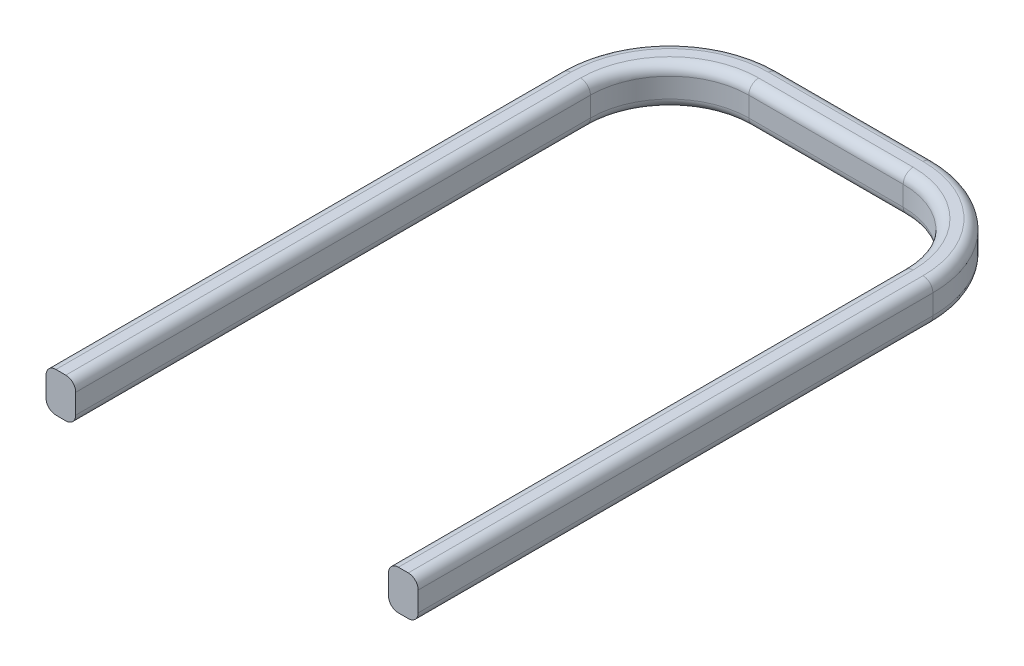
ISO-10303-21;
HEADER;
FILE_DESCRIPTION(('STEP AP214'),'2;1');
FILE_NAME('part.step','',(''),(''),'','','');
FILE_SCHEMA(('AUTOMOTIVE_DESIGN { 1 0 10303 214 1 1 1 1 }'));
ENDSEC;
DATA;
#1=APPLICATION_CONTEXT('core data for automotive mechanical design processes');
#2=APPLICATION_PROTOCOL_DEFINITION('international standard','automotive_design',2000,#1);
#3=PRODUCT_CONTEXT('',#1,'mechanical');
#4=PRODUCT('Part','Part','',(#3));
#5=PRODUCT_RELATED_PRODUCT_CATEGORY('part','',(#4));
#6=PRODUCT_DEFINITION_FORMATION('','',#4);
#7=PRODUCT_DEFINITION_CONTEXT('part definition',#1,'design');
#8=PRODUCT_DEFINITION('design','',#6,#7);
#9=PRODUCT_DEFINITION_SHAPE('','',#8);
#10=(LENGTH_UNIT() NAMED_UNIT(*) SI_UNIT(.MILLI.,.METRE.));
#11=(NAMED_UNIT(*) PLANE_ANGLE_UNIT() SI_UNIT($,.RADIAN.));
#12=(NAMED_UNIT(*) SI_UNIT($,.STERADIAN.) SOLID_ANGLE_UNIT());
#13=UNCERTAINTY_MEASURE_WITH_UNIT(LENGTH_MEASURE(1.E-05),#10,'distance_accuracy_value','');
#14=(GEOMETRIC_REPRESENTATION_CONTEXT(3) GLOBAL_UNCERTAINTY_ASSIGNED_CONTEXT((#13)) GLOBAL_UNIT_ASSIGNED_CONTEXT((#10,
#11,#12)) REPRESENTATION_CONTEXT('',''));
#15=CARTESIAN_POINT('',(0.,0.,0.));
#16=DIRECTION('',(0.,0.,1.));
#17=DIRECTION('',(1.,0.,0.));
#18=AXIS2_PLACEMENT_3D('',#15,#16,#17);
#19=CARTESIAN_POINT('',(3.95,1.,7.5));
#20=DIRECTION('',(0.,0.,-1.));
#21=DIRECTION('',(-1.,0.,0.));
#22=AXIS2_PLACEMENT_3D('',#19,#20,#21);
#23=PLANE('',#22);
#24=DIRECTION('',(0.,-1.,0.));
#25=VECTOR('',#24,1.);
#26=CARTESIAN_POINT('',(4.7,1.,7.5));
#27=LINE('',#26,#25);
#28=CARTESIAN_POINT('',(4.7,0.75,7.5));
#29=VERTEX_POINT('',#28);
#30=CARTESIAN_POINT('',(4.7,0.25,7.5));
#31=VERTEX_POINT('',#30);
#32=EDGE_CURVE('E232',#29,#31,#27,.T.);
#33=ORIENTED_EDGE('',*,*,#32,.F.);
#34=CARTESIAN_POINT('',(4.45,0.75,7.5));
#35=DIRECTION('',(0.,0.,-1.));
#36=DIRECTION('',(-1.,0.,0.));
#37=AXIS2_PLACEMENT_3D('',#34,#35,#36);
#38=CIRCLE('',#37,0.25);
#39=CARTESIAN_POINT('',(4.45,1.,7.5));
#40=VERTEX_POINT('',#39);
#41=EDGE_CURVE('E324',#29,#40,#38,.F.);
#42=ORIENTED_EDGE('',*,*,#41,.T.);
#43=DIRECTION('',(1.,0.,0.));
#44=VECTOR('',#43,1.);
#45=CARTESIAN_POINT('',(3.95,1.,7.5));
#46=LINE('',#45,#44);
#47=CARTESIAN_POINT('',(4.2,1.,7.5));
#48=VERTEX_POINT('',#47);
#49=EDGE_CURVE('E459',#48,#40,#46,.T.);
#50=ORIENTED_EDGE('',*,*,#49,.F.);
#51=CARTESIAN_POINT('',(4.2,0.75,7.5));
#52=DIRECTION('',(0.,0.,-1.));
#53=DIRECTION('',(-1.,0.,0.));
#54=AXIS2_PLACEMENT_3D('',#51,#52,#53);
#55=CIRCLE('',#54,0.25);
#56=CARTESIAN_POINT('',(3.95,0.75,7.5));
#57=VERTEX_POINT('',#56);
#58=EDGE_CURVE('E64',#48,#57,#55,.F.);
#59=ORIENTED_EDGE('',*,*,#58,.T.);
#60=DIRECTION('',(0.,-1.,0.));
#61=VECTOR('',#60,1.);
#62=CARTESIAN_POINT('',(3.95,1.,7.5));
#63=LINE('',#62,#61);
#64=CARTESIAN_POINT('',(3.95,0.25,7.5));
#65=VERTEX_POINT('',#64);
#66=EDGE_CURVE('E464',#57,#65,#63,.T.);
#67=ORIENTED_EDGE('',*,*,#66,.T.);
#68=CARTESIAN_POINT('',(4.2,0.25,7.5));
#69=DIRECTION('',(0.,0.,-1.));
#70=DIRECTION('',(-1.,0.,0.));
#71=AXIS2_PLACEMENT_3D('',#68,#69,#70);
#72=CIRCLE('',#71,0.25);
#73=CARTESIAN_POINT('',(4.2,0.,7.5));
#74=VERTEX_POINT('',#73);
#75=EDGE_CURVE('E319',#65,#74,#72,.F.);
#76=ORIENTED_EDGE('',*,*,#75,.T.);
#77=DIRECTION('',(1.,0.,0.));
#78=VECTOR('',#77,1.);
#79=CARTESIAN_POINT('',(3.95,0.,7.5));
#80=LINE('',#79,#78);
#81=CARTESIAN_POINT('',(4.45,0.,7.5));
#82=VERTEX_POINT('',#81);
#83=EDGE_CURVE('E340',#74,#82,#80,.T.);
#84=ORIENTED_EDGE('',*,*,#83,.T.);
#85=CARTESIAN_POINT('',(4.45,0.25,7.5));
#86=DIRECTION('',(0.,0.,-1.));
#87=DIRECTION('',(-1.,0.,0.));
#88=AXIS2_PLACEMENT_3D('',#85,#86,#87);
#89=CIRCLE('',#88,0.25);
#90=EDGE_CURVE('E321',#82,#31,#89,.F.);
#91=ORIENTED_EDGE('',*,*,#90,.T.);
#92=EDGE_LOOP('',(#33,#42,#50,#59,#67,#76,#84,#91));
#93=FACE_BOUND('',#92,.T.);
#94=ADVANCED_FACE('F41',(#93),#23,.F.);
#95=CARTESIAN_POINT('',(4.7,1.,-5.49999999999998));
#96=DIRECTION('',(-1.,0.,0.));
#97=DIRECTION('',(0.,0.,1.));
#98=AXIS2_PLACEMENT_3D('',#95,#96,#97);
#99=PLANE('',#98);
#100=DIRECTION('',(0.,-1.,0.));
#101=VECTOR('',#100,1.);
#102=CARTESIAN_POINT('',(4.7,1.,-5.49999999999998));
#103=LINE('',#102,#101);
#104=CARTESIAN_POINT('',(4.7,0.75,-5.49999999999998));
#105=VERTEX_POINT('',#104);
#106=CARTESIAN_POINT('',(4.7,0.25,-5.49999999999998));
#107=VERTEX_POINT('',#106);
#108=EDGE_CURVE('E236',#105,#107,#103,.T.);
#109=ORIENTED_EDGE('',*,*,#108,.F.);
#110=DIRECTION('',(0.,0.,-1.));
#111=VECTOR('',#110,1.);
#112=CARTESIAN_POINT('',(4.7,0.75,-5.49999999999998));
#113=LINE('',#112,#111);
#114=EDGE_CURVE('E317',#105,#29,#113,.F.);
#115=ORIENTED_EDGE('',*,*,#114,.T.);
#116=ORIENTED_EDGE('',*,*,#32,.T.);
#117=DIRECTION('',(0.,0.,-1.));
#118=VECTOR('',#117,1.);
#119=CARTESIAN_POINT('',(4.7,0.25,-5.49999999999998));
#120=LINE('',#119,#118);
#121=EDGE_CURVE('E315',#31,#107,#120,.T.);
#122=ORIENTED_EDGE('',*,*,#121,.T.);
#123=EDGE_LOOP('',(#109,#115,#116,#122));
#124=FACE_BOUND('',#123,.T.);
#125=ADVANCED_FACE('F450',(#124),#99,.F.);
#126=CARTESIAN_POINT('',(1.95,1.,-5.5));
#127=DIRECTION('',(0.,-1.,0.));
#128=DIRECTION('',(0.,0.,-1.));
#129=AXIS2_PLACEMENT_3D('',#126,#127,#128);
#130=CYLINDRICAL_SURFACE('',#129,2.75);
#131=ORIENTED_EDGE('',*,*,#108,.T.);
#132=CARTESIAN_POINT('',(1.95,0.25,-5.5));
#133=DIRECTION('',(0.,-1.,0.));
#134=DIRECTION('',(0.,0.,-1.));
#135=AXIS2_PLACEMENT_3D('',#132,#133,#134);
#136=CIRCLE('',#135,2.75);
#137=CARTESIAN_POINT('',(1.94999999999999,0.25,-8.25));
#138=VERTEX_POINT('',#137);
#139=EDGE_CURVE('E274',#107,#138,#136,.F.);
#140=ORIENTED_EDGE('',*,*,#139,.T.);
#141=DIRECTION('',(0.,-1.,0.));
#142=VECTOR('',#141,1.);
#143=CARTESIAN_POINT('',(1.94999999999999,1.,-8.25));
#144=LINE('',#143,#142);
#145=CARTESIAN_POINT('',(1.94999999999999,0.75,-8.25));
#146=VERTEX_POINT('',#145);
#147=EDGE_CURVE('E400',#146,#138,#144,.T.);
#148=ORIENTED_EDGE('',*,*,#147,.F.);
#149=CARTESIAN_POINT('',(1.95,0.75,-5.5));
#150=DIRECTION('',(0.,-1.,0.));
#151=DIRECTION('',(0.,0.,-1.));
#152=AXIS2_PLACEMENT_3D('',#149,#150,#151);
#153=CIRCLE('',#152,2.75);
#154=EDGE_CURVE('E272',#146,#105,#153,.T.);
#155=ORIENTED_EDGE('',*,*,#154,.T.);
#156=EDGE_LOOP('',(#131,#140,#148,#155));
#157=FACE_BOUND('',#156,.T.);
#158=ADVANCED_FACE('F406',(#157),#130,.T.);
#159=CARTESIAN_POINT('',(-1.94999999999998,1.,-8.25));
#160=DIRECTION('',(0.,0.,1.));
#161=DIRECTION('',(1.,0.,0.));
#162=AXIS2_PLACEMENT_3D('',#159,#160,#161);
#163=PLANE('',#162);
#164=ORIENTED_EDGE('',*,*,#147,.T.);
#165=DIRECTION('',(-1.,0.,0.));
#166=VECTOR('',#165,1.);
#167=CARTESIAN_POINT('',(-1.95,0.25,-8.25));
#168=LINE('',#167,#166);
#169=CARTESIAN_POINT('',(-1.95,0.25,-8.25));
#170=VERTEX_POINT('',#169);
#171=EDGE_CURVE('E270',#138,#170,#168,.T.);
#172=ORIENTED_EDGE('',*,*,#171,.T.);
#173=DIRECTION('',(0.,-1.,0.));
#174=VECTOR('',#173,1.);
#175=CARTESIAN_POINT('',(-1.95,1.,-8.25));
#176=LINE('',#175,#174);
#177=CARTESIAN_POINT('',(-1.95,0.75,-8.25));
#178=VERTEX_POINT('',#177);
#179=EDGE_CURVE('E397',#178,#170,#176,.T.);
#180=ORIENTED_EDGE('',*,*,#179,.F.);
#181=DIRECTION('',(-1.,0.,0.));
#182=VECTOR('',#181,1.);
#183=CARTESIAN_POINT('',(-1.94999999999998,0.75,-8.25));
#184=LINE('',#183,#182);
#185=EDGE_CURVE('E268',#178,#146,#184,.F.);
#186=ORIENTED_EDGE('',*,*,#185,.T.);
#187=EDGE_LOOP('',(#164,#172,#180,#186));
#188=FACE_BOUND('',#187,.T.);
#189=ADVANCED_FACE('F429',(#188),#163,.F.);
#190=CARTESIAN_POINT('',(-1.95,1.,-5.5));
#191=DIRECTION('',(0.,-1.,0.));
#192=DIRECTION('',(0.,0.,-1.));
#193=AXIS2_PLACEMENT_3D('',#190,#191,#192);
#194=CYLINDRICAL_SURFACE('',#193,2.75);
#195=ORIENTED_EDGE('',*,*,#179,.T.);
#196=CARTESIAN_POINT('',(-1.95,0.25,-5.5));
#197=DIRECTION('',(0.,-1.,0.));
#198=DIRECTION('',(0.,0.,-1.));
#199=AXIS2_PLACEMENT_3D('',#196,#197,#198);
#200=CIRCLE('',#199,2.75);
#201=CARTESIAN_POINT('',(-4.7,0.25,-5.49999999999999));
#202=VERTEX_POINT('',#201);
#203=EDGE_CURVE('E266',#170,#202,#200,.F.);
#204=ORIENTED_EDGE('',*,*,#203,.T.);
#205=DIRECTION('',(0.,-1.,0.));
#206=VECTOR('',#205,1.);
#207=CARTESIAN_POINT('',(-4.7,1.,-5.49999999999999));
#208=LINE('',#207,#206);
#209=CARTESIAN_POINT('',(-4.7,0.75,-5.49999999999999));
#210=VERTEX_POINT('',#209);
#211=EDGE_CURVE('E224',#210,#202,#208,.T.);
#212=ORIENTED_EDGE('',*,*,#211,.F.);
#213=CARTESIAN_POINT('',(-1.95,0.75,-5.5));
#214=DIRECTION('',(0.,-1.,0.));
#215=DIRECTION('',(0.,0.,-1.));
#216=AXIS2_PLACEMENT_3D('',#213,#214,#215);
#217=CIRCLE('',#216,2.75);
#218=EDGE_CURVE('E264',#210,#178,#217,.T.);
#219=ORIENTED_EDGE('',*,*,#218,.T.);
#220=EDGE_LOOP('',(#195,#204,#212,#219));
#221=FACE_BOUND('',#220,.T.);
#222=ADVANCED_FACE('F432',(#221),#194,.T.);
#223=CARTESIAN_POINT('',(-4.7,1.,-5.49999999999999));
#224=DIRECTION('',(1.,0.,0.));
#225=DIRECTION('',(0.,0.,-1.));
#226=AXIS2_PLACEMENT_3D('',#223,#224,#225);
#227=PLANE('',#226);
#228=ORIENTED_EDGE('',*,*,#211,.T.);
#229=DIRECTION('',(0.,0.,1.));
#230=VECTOR('',#229,1.);
#231=CARTESIAN_POINT('',(-4.7,0.25,7.5));
#232=LINE('',#231,#230);
#233=CARTESIAN_POINT('',(-4.7,0.25,7.5));
#234=VERTEX_POINT('',#233);
#235=EDGE_CURVE('E223',#202,#234,#232,.T.);
#236=ORIENTED_EDGE('',*,*,#235,.T.);
#237=DIRECTION('',(0.,-1.,0.));
#238=VECTOR('',#237,1.);
#239=CARTESIAN_POINT('',(-4.7,1.,7.5));
#240=LINE('',#239,#238);
#241=CARTESIAN_POINT('',(-4.7,0.75,7.5));
#242=VERTEX_POINT('',#241);
#243=EDGE_CURVE('E207',#242,#234,#240,.T.);
#244=ORIENTED_EDGE('',*,*,#243,.F.);
#245=DIRECTION('',(0.,0.,1.));
#246=VECTOR('',#245,1.);
#247=CARTESIAN_POINT('',(-4.7,0.75,-5.49999999999999));
#248=LINE('',#247,#246);
#249=EDGE_CURVE('E220',#242,#210,#248,.F.);
#250=ORIENTED_EDGE('',*,*,#249,.T.);
#251=EDGE_LOOP('',(#228,#236,#244,#250));
#252=FACE_BOUND('',#251,.T.);
#253=ADVANCED_FACE('F219',(#252),#227,.F.);
#254=CARTESIAN_POINT('',(-4.7,1.,7.5));
#255=DIRECTION('',(0.,0.,-1.));
#256=DIRECTION('',(-1.,0.,0.));
#257=AXIS2_PLACEMENT_3D('',#254,#255,#256);
#258=PLANE('',#257);
#259=ORIENTED_EDGE('',*,*,#243,.T.);
#260=CARTESIAN_POINT('',(-4.45,0.25,7.5));
#261=DIRECTION('',(0.,0.,-1.));
#262=DIRECTION('',(-1.,0.,0.));
#263=AXIS2_PLACEMENT_3D('',#260,#261,#262);
#264=CIRCLE('',#263,0.25);
#265=CARTESIAN_POINT('',(-4.45,0.,7.5));
#266=VERTEX_POINT('',#265);
#267=EDGE_CURVE('E242',#234,#266,#264,.F.);
#268=ORIENTED_EDGE('',*,*,#267,.T.);
#269=DIRECTION('',(1.,0.,0.));
#270=VECTOR('',#269,1.);
#271=CARTESIAN_POINT('',(-4.7,0.,7.5));
#272=LINE('',#271,#270);
#273=CARTESIAN_POINT('',(-4.2,0.,7.5));
#274=VERTEX_POINT('',#273);
#275=EDGE_CURVE('E457',#266,#274,#272,.T.);
#276=ORIENTED_EDGE('',*,*,#275,.T.);
#277=CARTESIAN_POINT('',(-4.2,0.25,7.5));
#278=DIRECTION('',(0.,0.,-1.));
#279=DIRECTION('',(-1.,0.,0.));
#280=AXIS2_PLACEMENT_3D('',#277,#278,#279);
#281=CIRCLE('',#280,0.25);
#282=CARTESIAN_POINT('',(-3.95,0.25,7.5));
#283=VERTEX_POINT('',#282);
#284=EDGE_CURVE('E213',#274,#283,#281,.F.);
#285=ORIENTED_EDGE('',*,*,#284,.T.);
#286=DIRECTION('',(0.,-1.,0.));
#287=VECTOR('',#286,1.);
#288=CARTESIAN_POINT('',(-3.95,1.,7.5));
#289=LINE('',#288,#287);
#290=CARTESIAN_POINT('',(-3.95,0.75,7.5));
#291=VERTEX_POINT('',#290);
#292=EDGE_CURVE('E225',#291,#283,#289,.T.);
#293=ORIENTED_EDGE('',*,*,#292,.F.);
#294=CARTESIAN_POINT('',(-4.2,0.75,7.5));
#295=DIRECTION('',(0.,0.,-1.));
#296=DIRECTION('',(-1.,0.,0.));
#297=AXIS2_PLACEMENT_3D('',#294,#295,#296);
#298=CIRCLE('',#297,0.25);
#299=CARTESIAN_POINT('',(-4.2,1.,7.5));
#300=VERTEX_POINT('',#299);
#301=EDGE_CURVE('E214',#291,#300,#298,.F.);
#302=ORIENTED_EDGE('',*,*,#301,.T.);
#303=DIRECTION('',(1.,0.,0.));
#304=VECTOR('',#303,1.);
#305=CARTESIAN_POINT('',(-4.7,1.,7.5));
#306=LINE('',#305,#304);
#307=CARTESIAN_POINT('',(-4.45,1.,7.5));
#308=VERTEX_POINT('',#307);
#309=EDGE_CURVE('E209',#308,#300,#306,.T.);
#310=ORIENTED_EDGE('',*,*,#309,.F.);
#311=CARTESIAN_POINT('',(-4.45,0.75,7.5));
#312=DIRECTION('',(0.,0.,-1.));
#313=DIRECTION('',(-1.,0.,0.));
#314=AXIS2_PLACEMENT_3D('',#311,#312,#313);
#315=CIRCLE('',#314,0.25);
#316=EDGE_CURVE('E204',#308,#242,#315,.F.);
#317=ORIENTED_EDGE('',*,*,#316,.T.);
#318=EDGE_LOOP('',(#259,#268,#276,#285,#293,#302,#310,#317));
#319=FACE_BOUND('',#318,.T.);
#320=ADVANCED_FACE('F206',(#319),#258,.F.);
#321=CARTESIAN_POINT('',(-3.95,1.,-5.49999999999999));
#322=DIRECTION('',(-1.,0.,0.));
#323=DIRECTION('',(0.,0.,1.));
#324=AXIS2_PLACEMENT_3D('',#321,#322,#323);
#325=PLANE('',#324);
#326=ORIENTED_EDGE('',*,*,#292,.T.);
#327=DIRECTION('',(0.,0.,-1.));
#328=VECTOR('',#327,1.);
#329=CARTESIAN_POINT('',(-3.95,0.25,-5.49999999999998));
#330=LINE('',#329,#328);
#331=CARTESIAN_POINT('',(-3.95,0.25,-5.49999999999998));
#332=VERTEX_POINT('',#331);
#333=EDGE_CURVE('E278',#283,#332,#330,.T.);
#334=ORIENTED_EDGE('',*,*,#333,.T.);
#335=DIRECTION('',(0.,-1.,0.));
#336=VECTOR('',#335,1.);
#337=CARTESIAN_POINT('',(-3.95,1.,-5.49999999999998));
#338=LINE('',#337,#336);
#339=CARTESIAN_POINT('',(-3.95,0.75,-5.49999999999998));
#340=VERTEX_POINT('',#339);
#341=EDGE_CURVE('E388',#340,#332,#338,.T.);
#342=ORIENTED_EDGE('',*,*,#341,.F.);
#343=DIRECTION('',(0.,0.,-1.));
#344=VECTOR('',#343,1.);
#345=CARTESIAN_POINT('',(-3.95,0.75,-5.49999999999999));
#346=LINE('',#345,#344);
#347=EDGE_CURVE('E276',#340,#291,#346,.F.);
#348=ORIENTED_EDGE('',*,*,#347,.T.);
#349=EDGE_LOOP('',(#326,#334,#342,#348));
#350=FACE_BOUND('',#349,.T.);
#351=ADVANCED_FACE('F385',(#350),#325,.F.);
#352=CARTESIAN_POINT('',(-1.95,1.,-5.5));
#353=DIRECTION('',(0.,-1.,0.));
#354=DIRECTION('',(0.,0.,-1.));
#355=AXIS2_PLACEMENT_3D('',#352,#353,#354);
#356=CYLINDRICAL_SURFACE('',#355,2.);
#357=ORIENTED_EDGE('',*,*,#341,.T.);
#358=CARTESIAN_POINT('',(-1.95,0.25,-5.5));
#359=DIRECTION('',(0.,-1.,0.));
#360=DIRECTION('',(0.,0.,-1.));
#361=AXIS2_PLACEMENT_3D('',#358,#359,#360);
#362=CIRCLE('',#361,2.);
#363=CARTESIAN_POINT('',(-1.94999999999999,0.25,-7.5));
#364=VERTEX_POINT('',#363);
#365=EDGE_CURVE('E283',#332,#364,#362,.T.);
#366=ORIENTED_EDGE('',*,*,#365,.T.);
#367=DIRECTION('',(0.,-1.,0.));
#368=VECTOR('',#367,1.);
#369=CARTESIAN_POINT('',(-1.94999999999999,1.,-7.5));
#370=LINE('',#369,#368);
#371=CARTESIAN_POINT('',(-1.94999999999999,0.75,-7.5));
#372=VERTEX_POINT('',#371);
#373=EDGE_CURVE('E392',#372,#364,#370,.T.);
#374=ORIENTED_EDGE('',*,*,#373,.F.);
#375=CARTESIAN_POINT('',(-1.95,0.75,-5.5));
#376=DIRECTION('',(0.,-1.,0.));
#377=DIRECTION('',(0.,0.,-1.));
#378=AXIS2_PLACEMENT_3D('',#375,#376,#377);
#379=CIRCLE('',#378,2.);
#380=EDGE_CURVE('E281',#372,#340,#379,.F.);
#381=ORIENTED_EDGE('',*,*,#380,.T.);
#382=EDGE_LOOP('',(#357,#366,#374,#381));
#383=FACE_BOUND('',#382,.T.);
#384=ADVANCED_FACE('F492',(#383),#356,.F.);
#385=CARTESIAN_POINT('',(-1.94999999999999,1.,-7.5));
#386=DIRECTION('',(0.,0.,-1.));
#387=DIRECTION('',(-1.,0.,0.));
#388=AXIS2_PLACEMENT_3D('',#385,#386,#387);
#389=PLANE('',#388);
#390=ORIENTED_EDGE('',*,*,#373,.T.);
#391=DIRECTION('',(1.,0.,0.));
#392=VECTOR('',#391,1.);
#393=CARTESIAN_POINT('',(1.94999999999999,0.25,-7.5));
#394=LINE('',#393,#392);
#395=CARTESIAN_POINT('',(1.94999999999999,0.25,-7.5));
#396=VERTEX_POINT('',#395);
#397=EDGE_CURVE('E287',#364,#396,#394,.T.);
#398=ORIENTED_EDGE('',*,*,#397,.T.);
#399=DIRECTION('',(0.,-1.,0.));
#400=VECTOR('',#399,1.);
#401=CARTESIAN_POINT('',(1.94999999999999,1.,-7.5));
#402=LINE('',#401,#400);
#403=CARTESIAN_POINT('',(1.94999999999999,0.75,-7.5));
#404=VERTEX_POINT('',#403);
#405=EDGE_CURVE('E468',#404,#396,#402,.T.);
#406=ORIENTED_EDGE('',*,*,#405,.F.);
#407=DIRECTION('',(1.,0.,0.));
#408=VECTOR('',#407,1.);
#409=CARTESIAN_POINT('',(-1.94999999999999,0.75,-7.5));
#410=LINE('',#409,#408);
#411=EDGE_CURVE('E285',#404,#372,#410,.F.);
#412=ORIENTED_EDGE('',*,*,#411,.T.);
#413=EDGE_LOOP('',(#390,#398,#406,#412));
#414=FACE_BOUND('',#413,.T.);
#415=ADVANCED_FACE('F474',(#414),#389,.F.);
#416=CARTESIAN_POINT('',(1.95,1.,-5.5));
#417=DIRECTION('',(0.,-1.,0.));
#418=DIRECTION('',(0.,0.,-1.));
#419=AXIS2_PLACEMENT_3D('',#416,#417,#418);
#420=CYLINDRICAL_SURFACE('',#419,2.);
#421=ORIENTED_EDGE('',*,*,#405,.T.);
#422=CARTESIAN_POINT('',(1.95,0.25,-5.5));
#423=DIRECTION('',(0.,-1.,0.));
#424=DIRECTION('',(0.,0.,-1.));
#425=AXIS2_PLACEMENT_3D('',#422,#423,#424);
#426=CIRCLE('',#425,2.);
#427=CARTESIAN_POINT('',(3.95,0.25,-5.49999999999999));
#428=VERTEX_POINT('',#427);
#429=EDGE_CURVE('E291',#396,#428,#426,.T.);
#430=ORIENTED_EDGE('',*,*,#429,.T.);
#431=DIRECTION('',(0.,-1.,0.));
#432=VECTOR('',#431,1.);
#433=CARTESIAN_POINT('',(3.95,1.,-5.49999999999999));
#434=LINE('',#433,#432);
#435=CARTESIAN_POINT('',(3.95,0.75,-5.49999999999999));
#436=VERTEX_POINT('',#435);
#437=EDGE_CURVE('E466',#436,#428,#434,.T.);
#438=ORIENTED_EDGE('',*,*,#437,.F.);
#439=CARTESIAN_POINT('',(1.95,0.75,-5.5));
#440=DIRECTION('',(0.,-1.,0.));
#441=DIRECTION('',(0.,0.,-1.));
#442=AXIS2_PLACEMENT_3D('',#439,#440,#441);
#443=CIRCLE('',#442,2.);
#444=EDGE_CURVE('E289',#436,#404,#443,.F.);
#445=ORIENTED_EDGE('',*,*,#444,.T.);
#446=EDGE_LOOP('',(#421,#430,#438,#445));
#447=FACE_BOUND('',#446,.T.);
#448=ADVANCED_FACE('F499',(#447),#420,.F.);
#449=CARTESIAN_POINT('',(3.95,1.,-5.49999999999999));
#450=DIRECTION('',(1.,0.,0.));
#451=DIRECTION('',(0.,0.,-1.));
#452=AXIS2_PLACEMENT_3D('',#449,#450,#451);
#453=PLANE('',#452);
#454=ORIENTED_EDGE('',*,*,#66,.F.);
#455=DIRECTION('',(0.,0.,1.));
#456=VECTOR('',#455,1.);
#457=CARTESIAN_POINT('',(3.95,0.75,-5.49999999999999));
#458=LINE('',#457,#456);
#459=EDGE_CURVE('E11',#57,#436,#458,.F.);
#460=ORIENTED_EDGE('',*,*,#459,.T.);
#461=ORIENTED_EDGE('',*,*,#437,.T.);
#462=DIRECTION('',(0.,0.,1.));
#463=VECTOR('',#462,1.);
#464=CARTESIAN_POINT('',(3.95,0.25,7.5));
#465=LINE('',#464,#463);
#466=EDGE_CURVE('E50',#428,#65,#465,.T.);
#467=ORIENTED_EDGE('',*,*,#466,.T.);
#468=EDGE_LOOP('',(#454,#460,#461,#467));
#469=FACE_BOUND('',#468,.T.);
#470=ADVANCED_FACE('F637',(#469),#453,.F.);
#471=CARTESIAN_POINT('',(1.95,1.,-5.5));
#472=DIRECTION('',(0.,-1.,0.));
#473=DIRECTION('',(0.,0.,-1.));
#474=AXIS2_PLACEMENT_3D('',#471,#472,#473);
#475=PLANE('',#474);
#476=ORIENTED_EDGE('',*,*,#49,.T.);
#477=DIRECTION('',(0.,0.,-1.));
#478=VECTOR('',#477,1.);
#479=CARTESIAN_POINT('',(4.45,1.,-5.5));
#480=LINE('',#479,#478);
#481=CARTESIAN_POINT('',(4.45,1.,-5.49999999999998));
#482=VERTEX_POINT('',#481);
#483=EDGE_CURVE('E312',#40,#482,#480,.T.);
#484=ORIENTED_EDGE('',*,*,#483,.T.);
#485=CARTESIAN_POINT('',(1.95,1.,-5.5));
#486=DIRECTION('',(0.,-1.,0.));
#487=DIRECTION('',(0.,0.,-1.));
#488=AXIS2_PLACEMENT_3D('',#485,#486,#487);
#489=CIRCLE('',#488,2.5);
#490=CARTESIAN_POINT('',(1.94999999999999,1.,-8.));
#491=VERTEX_POINT('',#490);
#492=EDGE_CURVE('E310',#482,#491,#489,.F.);
#493=ORIENTED_EDGE('',*,*,#492,.T.);
#494=DIRECTION('',(-1.,0.,0.));
#495=VECTOR('',#494,1.);
#496=CARTESIAN_POINT('',(1.95,1.,-8.));
#497=LINE('',#496,#495);
#498=CARTESIAN_POINT('',(-1.95,1.,-8.));
#499=VERTEX_POINT('',#498);
#500=EDGE_CURVE('E308',#491,#499,#497,.T.);
#501=ORIENTED_EDGE('',*,*,#500,.T.);
#502=CARTESIAN_POINT('',(-1.95,1.,-5.5));
#503=DIRECTION('',(0.,-1.,0.));
#504=DIRECTION('',(0.,0.,-1.));
#505=AXIS2_PLACEMENT_3D('',#502,#503,#504);
#506=CIRCLE('',#505,2.5);
#507=CARTESIAN_POINT('',(-4.45,1.,-5.49999999999999));
#508=VERTEX_POINT('',#507);
#509=EDGE_CURVE('E306',#499,#508,#506,.F.);
#510=ORIENTED_EDGE('',*,*,#509,.T.);
#511=DIRECTION('',(0.,0.,1.));
#512=VECTOR('',#511,1.);
#513=CARTESIAN_POINT('',(-4.45,1.,-5.5));
#514=LINE('',#513,#512);
#515=EDGE_CURVE('E304',#508,#308,#514,.T.);
#516=ORIENTED_EDGE('',*,*,#515,.T.);
#517=ORIENTED_EDGE('',*,*,#309,.T.);
#518=DIRECTION('',(0.,0.,-1.));
#519=VECTOR('',#518,1.);
#520=CARTESIAN_POINT('',(-4.2,1.,-5.5));
#521=LINE('',#520,#519);
#522=CARTESIAN_POINT('',(-4.2,1.,-5.49999999999998));
#523=VERTEX_POINT('',#522);
#524=EDGE_CURVE('E293',#300,#523,#521,.T.);
#525=ORIENTED_EDGE('',*,*,#524,.T.);
#526=CARTESIAN_POINT('',(-1.95,1.,-5.5));
#527=DIRECTION('',(0.,-1.,0.));
#528=DIRECTION('',(0.,0.,-1.));
#529=AXIS2_PLACEMENT_3D('',#526,#527,#528);
#530=CIRCLE('',#529,2.25);
#531=CARTESIAN_POINT('',(-1.94999999999999,1.,-7.75));
#532=VERTEX_POINT('',#531);
#533=EDGE_CURVE('E295',#523,#532,#530,.T.);
#534=ORIENTED_EDGE('',*,*,#533,.T.);
#535=DIRECTION('',(1.,0.,0.));
#536=VECTOR('',#535,1.);
#537=CARTESIAN_POINT('',(1.95,1.,-7.75));
#538=LINE('',#537,#536);
#539=CARTESIAN_POINT('',(1.94999999999998,1.,-7.75));
#540=VERTEX_POINT('',#539);
#541=EDGE_CURVE('E297',#532,#540,#538,.T.);
#542=ORIENTED_EDGE('',*,*,#541,.T.);
#543=CARTESIAN_POINT('',(1.95,1.,-5.5));
#544=DIRECTION('',(0.,-1.,0.));
#545=DIRECTION('',(0.,0.,-1.));
#546=AXIS2_PLACEMENT_3D('',#543,#544,#545);
#547=CIRCLE('',#546,2.25);
#548=CARTESIAN_POINT('',(4.2,1.,-5.49999999999999));
#549=VERTEX_POINT('',#548);
#550=EDGE_CURVE('E299',#540,#549,#547,.T.);
#551=ORIENTED_EDGE('',*,*,#550,.T.);
#552=DIRECTION('',(0.,0.,1.));
#553=VECTOR('',#552,1.);
#554=CARTESIAN_POINT('',(4.2,1.,-5.5));
#555=LINE('',#554,#553);
#556=EDGE_CURVE('E301',#549,#48,#555,.T.);
#557=ORIENTED_EDGE('',*,*,#556,.T.);
#558=EDGE_LOOP('',(#476,#484,#493,#501,#510,#516,#517,#525,#534,#542,#551,#557));
#559=FACE_BOUND('',#558,.T.);
#560=ADVANCED_FACE('F630',(#559),#475,.F.);
#561=CARTESIAN_POINT('',(1.95,0.,-5.5));
#562=DIRECTION('',(0.,-1.,0.));
#563=DIRECTION('',(0.,0.,-1.));
#564=AXIS2_PLACEMENT_3D('',#561,#562,#563);
#565=PLANE('',#564);
#566=ORIENTED_EDGE('',*,*,#275,.F.);
#567=DIRECTION('',(0.,0.,1.));
#568=VECTOR('',#567,1.);
#569=CARTESIAN_POINT('',(-4.45,0.,-5.49999999999999));
#570=LINE('',#569,#568);
#571=CARTESIAN_POINT('',(-4.45,0.,-5.49999999999999));
#572=VERTEX_POINT('',#571);
#573=EDGE_CURVE('E262',#266,#572,#570,.F.);
#574=ORIENTED_EDGE('',*,*,#573,.T.);
#575=CARTESIAN_POINT('',(-1.95,0.,-5.5));
#576=DIRECTION('',(0.,-1.,0.));
#577=DIRECTION('',(0.,0.,-1.));
#578=AXIS2_PLACEMENT_3D('',#575,#576,#577);
#579=CIRCLE('',#578,2.5);
#580=CARTESIAN_POINT('',(-1.95,0.,-8.));
#581=VERTEX_POINT('',#580);
#582=EDGE_CURVE('E260',#572,#581,#579,.T.);
#583=ORIENTED_EDGE('',*,*,#582,.T.);
#584=DIRECTION('',(-1.,0.,0.));
#585=VECTOR('',#584,1.);
#586=CARTESIAN_POINT('',(1.94999999999998,0.,-8.));
#587=LINE('',#586,#585);
#588=CARTESIAN_POINT('',(1.94999999999999,0.,-8.));
#589=VERTEX_POINT('',#588);
#590=EDGE_CURVE('E258',#581,#589,#587,.F.);
#591=ORIENTED_EDGE('',*,*,#590,.T.);
#592=CARTESIAN_POINT('',(1.95,0.,-5.5));
#593=DIRECTION('',(0.,-1.,0.));
#594=DIRECTION('',(0.,0.,-1.));
#595=AXIS2_PLACEMENT_3D('',#592,#593,#594);
#596=CIRCLE('',#595,2.5);
#597=CARTESIAN_POINT('',(4.45,0.,-5.49999999999998));
#598=VERTEX_POINT('',#597);
#599=EDGE_CURVE('E256',#589,#598,#596,.T.);
#600=ORIENTED_EDGE('',*,*,#599,.T.);
#601=DIRECTION('',(0.,0.,-1.));
#602=VECTOR('',#601,1.);
#603=CARTESIAN_POINT('',(4.45,0.,7.5));
#604=LINE('',#603,#602);
#605=EDGE_CURVE('E254',#598,#82,#604,.F.);
#606=ORIENTED_EDGE('',*,*,#605,.T.);
#607=ORIENTED_EDGE('',*,*,#83,.F.);
#608=DIRECTION('',(0.,0.,1.));
#609=VECTOR('',#608,1.);
#610=CARTESIAN_POINT('',(4.2,0.,-5.49999999999999));
#611=LINE('',#610,#609);
#612=CARTESIAN_POINT('',(4.2,0.,-5.49999999999998));
#613=VERTEX_POINT('',#612);
#614=EDGE_CURVE('E244',#74,#613,#611,.F.);
#615=ORIENTED_EDGE('',*,*,#614,.T.);
#616=CARTESIAN_POINT('',(1.95,0.,-5.5));
#617=DIRECTION('',(0.,-1.,0.));
#618=DIRECTION('',(0.,0.,-1.));
#619=AXIS2_PLACEMENT_3D('',#616,#617,#618);
#620=CIRCLE('',#619,2.25);
#621=CARTESIAN_POINT('',(1.94999999999999,0.,-7.75));
#622=VERTEX_POINT('',#621);
#623=EDGE_CURVE('E246',#613,#622,#620,.F.);
#624=ORIENTED_EDGE('',*,*,#623,.T.);
#625=DIRECTION('',(1.,0.,0.));
#626=VECTOR('',#625,1.);
#627=CARTESIAN_POINT('',(-1.94999999999999,0.,-7.75));
#628=LINE('',#627,#626);
#629=CARTESIAN_POINT('',(-1.94999999999998,0.,-7.75));
#630=VERTEX_POINT('',#629);
#631=EDGE_CURVE('E248',#622,#630,#628,.F.);
#632=ORIENTED_EDGE('',*,*,#631,.T.);
#633=CARTESIAN_POINT('',(-1.95,0.,-5.5));
#634=DIRECTION('',(0.,-1.,0.));
#635=DIRECTION('',(0.,0.,-1.));
#636=AXIS2_PLACEMENT_3D('',#633,#634,#635);
#637=CIRCLE('',#636,2.25);
#638=CARTESIAN_POINT('',(-4.2,0.,-5.49999999999998));
#639=VERTEX_POINT('',#638);
#640=EDGE_CURVE('E250',#630,#639,#637,.F.);
#641=ORIENTED_EDGE('',*,*,#640,.T.);
#642=DIRECTION('',(0.,0.,-1.));
#643=VECTOR('',#642,1.);
#644=CARTESIAN_POINT('',(-4.2,0.,7.5));
#645=LINE('',#644,#643);
#646=EDGE_CURVE('E252',#639,#274,#645,.F.);
#647=ORIENTED_EDGE('',*,*,#646,.T.);
#648=EDGE_LOOP('',(#566,#574,#583,#591,#600,#606,#607,#615,#624,#632,#641,#647));
#649=FACE_BOUND('',#648,.T.);
#650=ADVANCED_FACE('F489',(#649),#565,.T.);
#651=CARTESIAN_POINT('',(4.45,0.25,-5.49999999999998));
#652=DIRECTION('',(0.,0.,1.));
#653=DIRECTION('',(1.,0.,0.));
#654=AXIS2_PLACEMENT_3D('',#651,#652,#653);
#655=CYLINDRICAL_SURFACE('',#654,0.25);
#656=ORIENTED_EDGE('',*,*,#90,.F.);
#657=ORIENTED_EDGE('',*,*,#605,.F.);
#658=CARTESIAN_POINT('',(4.45,0.25,-5.49999999999998));
#659=DIRECTION('',(0.,0.,-1.));
#660=DIRECTION('',(0.,1.,0.));
#661=AXIS2_PLACEMENT_3D('',#658,#659,#660);
#662=CIRCLE('',#661,0.25);
#663=EDGE_CURVE('E337',#107,#598,#662,.T.);
#664=ORIENTED_EDGE('',*,*,#663,.F.);
#665=ORIENTED_EDGE('',*,*,#121,.F.);
#666=EDGE_LOOP('',(#656,#657,#664,#665));
#667=FACE_BOUND('',#666,.T.);
#668=ADVANCED_FACE('F416',(#667),#655,.T.);
#669=CARTESIAN_POINT('',(1.95,0.25,-5.5));
#670=DIRECTION('',(0.,-1.,0.));
#671=DIRECTION('',(0.,0.,-1.));
#672=AXIS2_PLACEMENT_3D('',#669,#670,#671);
#673=TOROIDAL_SURFACE('',#672,2.5,0.25);
#674=ORIENTED_EDGE('',*,*,#663,.T.);
#675=ORIENTED_EDGE('',*,*,#599,.F.);
#676=CARTESIAN_POINT('',(1.94999999999999,0.25,-8.));
#677=DIRECTION('',(-1.,0.,0.));
#678=DIRECTION('',(0.,-1.,0.));
#679=AXIS2_PLACEMENT_3D('',#676,#677,#678);
#680=CIRCLE('',#679,0.25);
#681=EDGE_CURVE('E334',#138,#589,#680,.T.);
#682=ORIENTED_EDGE('',*,*,#681,.F.);
#683=ORIENTED_EDGE('',*,*,#139,.F.);
#684=EDGE_LOOP('',(#674,#675,#682,#683));
#685=FACE_BOUND('',#684,.T.);
#686=ADVANCED_FACE('F420',(#685),#673,.T.);
#687=CARTESIAN_POINT('',(-1.94999999999998,0.25,-8.));
#688=DIRECTION('',(1.,0.,0.));
#689=DIRECTION('',(0.,0.,-1.));
#690=AXIS2_PLACEMENT_3D('',#687,#688,#689);
#691=CYLINDRICAL_SURFACE('',#690,0.25);
#692=ORIENTED_EDGE('',*,*,#681,.T.);
#693=ORIENTED_EDGE('',*,*,#590,.F.);
#694=CARTESIAN_POINT('',(-1.95,0.25,-8.));
#695=DIRECTION('',(-1.,0.,0.));
#696=DIRECTION('',(0.,0.,1.));
#697=AXIS2_PLACEMENT_3D('',#694,#695,#696);
#698=CIRCLE('',#697,0.25);
#699=EDGE_CURVE('E330',#170,#581,#698,.T.);
#700=ORIENTED_EDGE('',*,*,#699,.F.);
#701=ORIENTED_EDGE('',*,*,#171,.F.);
#702=EDGE_LOOP('',(#692,#693,#700,#701));
#703=FACE_BOUND('',#702,.T.);
#704=ADVANCED_FACE('F425',(#703),#691,.T.);
#705=CARTESIAN_POINT('',(-1.95,0.25,-5.5));
#706=DIRECTION('',(0.,-1.,0.));
#707=DIRECTION('',(0.,0.,-1.));
#708=AXIS2_PLACEMENT_3D('',#705,#706,#707);
#709=TOROIDAL_SURFACE('',#708,2.5,0.25);
#710=ORIENTED_EDGE('',*,*,#699,.T.);
#711=ORIENTED_EDGE('',*,*,#582,.F.);
#712=CARTESIAN_POINT('',(-4.45,0.25,-5.49999999999999));
#713=DIRECTION('',(0.,0.,1.));
#714=DIRECTION('',(0.,-1.,0.));
#715=AXIS2_PLACEMENT_3D('',#712,#713,#714);
#716=CIRCLE('',#715,0.25);
#717=EDGE_CURVE('E327',#202,#572,#716,.T.);
#718=ORIENTED_EDGE('',*,*,#717,.F.);
#719=ORIENTED_EDGE('',*,*,#203,.F.);
#720=EDGE_LOOP('',(#710,#711,#718,#719));
#721=FACE_BOUND('',#720,.T.);
#722=ADVANCED_FACE('F514',(#721),#709,.T.);
#723=CARTESIAN_POINT('',(-4.45,0.25,-5.49999999999999));
#724=DIRECTION('',(0.,0.,-1.));
#725=DIRECTION('',(-1.,0.,0.));
#726=AXIS2_PLACEMENT_3D('',#723,#724,#725);
#727=CYLINDRICAL_SURFACE('',#726,0.25);
#728=ORIENTED_EDGE('',*,*,#717,.T.);
#729=ORIENTED_EDGE('',*,*,#573,.F.);
#730=ORIENTED_EDGE('',*,*,#267,.F.);
#731=ORIENTED_EDGE('',*,*,#235,.F.);
#732=EDGE_LOOP('',(#728,#729,#730,#731));
#733=FACE_BOUND('',#732,.T.);
#734=ADVANCED_FACE('F510',(#733),#727,.T.);
#735=CARTESIAN_POINT('',(4.2,0.25,-5.49999999999999));
#736=DIRECTION('',(0.,0.,-1.));
#737=DIRECTION('',(-1.,0.,0.));
#738=AXIS2_PLACEMENT_3D('',#735,#736,#737);
#739=CYLINDRICAL_SURFACE('',#738,0.25);
#740=ORIENTED_EDGE('',*,*,#75,.F.);
#741=ORIENTED_EDGE('',*,*,#466,.F.);
#742=CARTESIAN_POINT('',(4.2,0.25,-5.49999999999998));
#743=DIRECTION('',(0.,0.,-1.));
#744=DIRECTION('',(-1.,0.,0.));
#745=AXIS2_PLACEMENT_3D('',#742,#743,#744);
#746=CIRCLE('',#745,0.25);
#747=EDGE_CURVE('E331',#613,#428,#746,.T.);
#748=ORIENTED_EDGE('',*,*,#747,.F.);
#749=ORIENTED_EDGE('',*,*,#614,.F.);
#750=EDGE_LOOP('',(#740,#741,#748,#749));
#751=FACE_BOUND('',#750,.T.);
#752=ADVANCED_FACE('F513',(#751),#739,.T.);
#753=CARTESIAN_POINT('',(1.95,0.25,-5.5));
#754=DIRECTION('',(0.,-1.,0.));
#755=DIRECTION('',(0.,0.,-1.));
#756=AXIS2_PLACEMENT_3D('',#753,#754,#755);
#757=TOROIDAL_SURFACE('',#756,2.25,0.25);
#758=ORIENTED_EDGE('',*,*,#747,.T.);
#759=ORIENTED_EDGE('',*,*,#429,.F.);
#760=CARTESIAN_POINT('',(1.94999999999999,0.25,-7.75));
#761=DIRECTION('',(-1.,0.,0.));
#762=DIRECTION('',(0.,0.,1.));
#763=AXIS2_PLACEMENT_3D('',#760,#761,#762);
#764=CIRCLE('',#763,0.25);
#765=EDGE_CURVE('E346',#622,#396,#764,.T.);
#766=ORIENTED_EDGE('',*,*,#765,.F.);
#767=ORIENTED_EDGE('',*,*,#623,.F.);
#768=EDGE_LOOP('',(#758,#759,#766,#767));
#769=FACE_BOUND('',#768,.T.);
#770=ADVANCED_FACE('F531',(#769),#757,.T.);
#771=CARTESIAN_POINT('',(-1.94999999999999,0.25,-7.75));
#772=DIRECTION('',(-1.,0.,0.));
#773=DIRECTION('',(0.,0.,1.));
#774=AXIS2_PLACEMENT_3D('',#771,#772,#773);
#775=CYLINDRICAL_SURFACE('',#774,0.25);
#776=ORIENTED_EDGE('',*,*,#765,.T.);
#777=ORIENTED_EDGE('',*,*,#397,.F.);
#778=CARTESIAN_POINT('',(-1.94999999999998,0.25,-7.75));
#779=DIRECTION('',(-1.,0.,0.));
#780=DIRECTION('',(0.,0.,1.));
#781=AXIS2_PLACEMENT_3D('',#778,#779,#780);
#782=CIRCLE('',#781,0.25);
#783=EDGE_CURVE('E343',#630,#364,#782,.T.);
#784=ORIENTED_EDGE('',*,*,#783,.F.);
#785=ORIENTED_EDGE('',*,*,#631,.F.);
#786=EDGE_LOOP('',(#776,#777,#784,#785));
#787=FACE_BOUND('',#786,.T.);
#788=ADVANCED_FACE('F479',(#787),#775,.T.);
#789=CARTESIAN_POINT('',(-1.95,0.25,-5.5));
#790=DIRECTION('',(0.,-1.,0.));
#791=DIRECTION('',(0.,0.,-1.));
#792=AXIS2_PLACEMENT_3D('',#789,#790,#791);
#793=TOROIDAL_SURFACE('',#792,2.25,0.25);
#794=ORIENTED_EDGE('',*,*,#783,.T.);
#795=ORIENTED_EDGE('',*,*,#365,.F.);
#796=CARTESIAN_POINT('',(-4.2,0.25,-5.49999999999998));
#797=DIRECTION('',(0.,0.,1.));
#798=DIRECTION('',(1.,0.,0.));
#799=AXIS2_PLACEMENT_3D('',#796,#797,#798);
#800=CIRCLE('',#799,0.25);
#801=EDGE_CURVE('E341',#639,#332,#800,.T.);
#802=ORIENTED_EDGE('',*,*,#801,.F.);
#803=ORIENTED_EDGE('',*,*,#640,.F.);
#804=EDGE_LOOP('',(#794,#795,#802,#803));
#805=FACE_BOUND('',#804,.T.);
#806=ADVANCED_FACE('F485',(#805),#793,.T.);
#807=CARTESIAN_POINT('',(-4.2,0.25,-5.49999999999999));
#808=DIRECTION('',(0.,0.,1.));
#809=DIRECTION('',(1.,0.,0.));
#810=AXIS2_PLACEMENT_3D('',#807,#808,#809);
#811=CYLINDRICAL_SURFACE('',#810,0.25);
#812=ORIENTED_EDGE('',*,*,#284,.F.);
#813=ORIENTED_EDGE('',*,*,#646,.F.);
#814=ORIENTED_EDGE('',*,*,#801,.T.);
#815=ORIENTED_EDGE('',*,*,#333,.F.);
#816=EDGE_LOOP('',(#812,#813,#814,#815));
#817=FACE_BOUND('',#816,.T.);
#818=ADVANCED_FACE('F491',(#817),#811,.T.);
#819=CARTESIAN_POINT('',(-4.45,0.75,-5.5));
#820=DIRECTION('',(0.,0.,1.));
#821=DIRECTION('',(1.,0.,0.));
#822=AXIS2_PLACEMENT_3D('',#819,#820,#821);
#823=CYLINDRICAL_SURFACE('',#822,0.25);
#824=ORIENTED_EDGE('',*,*,#316,.F.);
#825=ORIENTED_EDGE('',*,*,#515,.F.);
#826=CARTESIAN_POINT('',(-4.45,0.75,-5.49999999999999));
#827=DIRECTION('',(0.,0.,-1.));
#828=DIRECTION('',(0.,1.,0.));
#829=AXIS2_PLACEMENT_3D('',#826,#827,#828);
#830=CIRCLE('',#829,0.25);
#831=EDGE_CURVE('E230',#210,#508,#830,.T.);
#832=ORIENTED_EDGE('',*,*,#831,.F.);
#833=ORIENTED_EDGE('',*,*,#249,.F.);
#834=EDGE_LOOP('',(#824,#825,#832,#833));
#835=FACE_BOUND('',#834,.T.);
#836=ADVANCED_FACE('F228',(#835),#823,.T.);
#837=CARTESIAN_POINT('',(-1.95,0.75,-5.5));
#838=DIRECTION('',(0.,-1.,0.));
#839=DIRECTION('',(0.,0.,-1.));
#840=AXIS2_PLACEMENT_3D('',#837,#838,#839);
#841=TOROIDAL_SURFACE('',#840,2.5,0.25);
#842=ORIENTED_EDGE('',*,*,#831,.T.);
#843=ORIENTED_EDGE('',*,*,#509,.F.);
#844=CARTESIAN_POINT('',(-1.95,0.75,-8.));
#845=DIRECTION('',(1.,0.,0.));
#846=DIRECTION('',(0.,0.,-1.));
#847=AXIS2_PLACEMENT_3D('',#844,#845,#846);
#848=CIRCLE('',#847,0.25);
#849=EDGE_CURVE('E356',#178,#499,#848,.T.);
#850=ORIENTED_EDGE('',*,*,#849,.F.);
#851=ORIENTED_EDGE('',*,*,#218,.F.);
#852=EDGE_LOOP('',(#842,#843,#850,#851));
#853=FACE_BOUND('',#852,.T.);
#854=ADVANCED_FACE('F434',(#853),#841,.T.);
#855=CARTESIAN_POINT('',(1.95,0.75,-8.));
#856=DIRECTION('',(-1.,0.,0.));
#857=DIRECTION('',(0.,0.,1.));
#858=AXIS2_PLACEMENT_3D('',#855,#856,#857);
#859=CYLINDRICAL_SURFACE('',#858,0.25);
#860=ORIENTED_EDGE('',*,*,#849,.T.);
#861=ORIENTED_EDGE('',*,*,#500,.F.);
#862=CARTESIAN_POINT('',(1.94999999999999,0.75,-8.));
#863=DIRECTION('',(1.,0.,0.));
#864=DIRECTION('',(0.,1.,0.));
#865=AXIS2_PLACEMENT_3D('',#862,#863,#864);
#866=CIRCLE('',#865,0.25);
#867=EDGE_CURVE('E353',#146,#491,#866,.T.);
#868=ORIENTED_EDGE('',*,*,#867,.F.);
#869=ORIENTED_EDGE('',*,*,#185,.F.);
#870=EDGE_LOOP('',(#860,#861,#868,#869));
#871=FACE_BOUND('',#870,.T.);
#872=ADVANCED_FACE('F440',(#871),#859,.T.);
#873=CARTESIAN_POINT('',(1.95,0.75,-5.5));
#874=DIRECTION('',(0.,-1.,0.));
#875=DIRECTION('',(0.,0.,-1.));
#876=AXIS2_PLACEMENT_3D('',#873,#874,#875);
#877=TOROIDAL_SURFACE('',#876,2.5,0.25);
#878=ORIENTED_EDGE('',*,*,#867,.T.);
#879=ORIENTED_EDGE('',*,*,#492,.F.);
#880=CARTESIAN_POINT('',(4.45,0.75,-5.49999999999998));
#881=DIRECTION('',(0.,0.,1.));
#882=DIRECTION('',(0.,-1.,0.));
#883=AXIS2_PLACEMENT_3D('',#880,#881,#882);
#884=CIRCLE('',#883,0.25);
#885=EDGE_CURVE('E351',#105,#482,#884,.T.);
#886=ORIENTED_EDGE('',*,*,#885,.F.);
#887=ORIENTED_EDGE('',*,*,#154,.F.);
#888=EDGE_LOOP('',(#878,#879,#886,#887));
#889=FACE_BOUND('',#888,.T.);
#890=ADVANCED_FACE('F444',(#889),#877,.T.);
#891=CARTESIAN_POINT('',(4.45,0.75,-5.5));
#892=DIRECTION('',(0.,0.,-1.));
#893=DIRECTION('',(-1.,0.,0.));
#894=AXIS2_PLACEMENT_3D('',#891,#892,#893);
#895=CYLINDRICAL_SURFACE('',#894,0.25);
#896=ORIENTED_EDGE('',*,*,#41,.F.);
#897=ORIENTED_EDGE('',*,*,#114,.F.);
#898=ORIENTED_EDGE('',*,*,#885,.T.);
#899=ORIENTED_EDGE('',*,*,#483,.F.);
#900=EDGE_LOOP('',(#896,#897,#898,#899));
#901=FACE_BOUND('',#900,.T.);
#902=ADVANCED_FACE('F448',(#901),#895,.T.);
#903=CARTESIAN_POINT('',(-4.2,0.75,-5.5));
#904=DIRECTION('',(0.,0.,-1.));
#905=DIRECTION('',(-1.,0.,0.));
#906=AXIS2_PLACEMENT_3D('',#903,#904,#905);
#907=CYLINDRICAL_SURFACE('',#906,0.25);
#908=ORIENTED_EDGE('',*,*,#301,.F.);
#909=ORIENTED_EDGE('',*,*,#347,.F.);
#910=CARTESIAN_POINT('',(-4.2,0.75,-5.49999999999998));
#911=DIRECTION('',(0.,0.,-1.));
#912=DIRECTION('',(-1.,0.,0.));
#913=AXIS2_PLACEMENT_3D('',#910,#911,#912);
#914=CIRCLE('',#913,0.25);
#915=EDGE_CURVE('E45',#523,#340,#914,.T.);
#916=ORIENTED_EDGE('',*,*,#915,.F.);
#917=ORIENTED_EDGE('',*,*,#524,.F.);
#918=EDGE_LOOP('',(#908,#909,#916,#917));
#919=FACE_BOUND('',#918,.T.);
#920=ADVANCED_FACE('F43',(#919),#907,.T.);
#921=CARTESIAN_POINT('',(-1.95,0.75,-5.5));
#922=DIRECTION('',(0.,-1.,0.));
#923=DIRECTION('',(0.,0.,-1.));
#924=AXIS2_PLACEMENT_3D('',#921,#922,#923);
#925=TOROIDAL_SURFACE('',#924,2.25,0.25);
#926=ORIENTED_EDGE('',*,*,#915,.T.);
#927=ORIENTED_EDGE('',*,*,#380,.F.);
#928=CARTESIAN_POINT('',(-1.94999999999999,0.75,-7.75));
#929=DIRECTION('',(1.,0.,0.));
#930=DIRECTION('',(0.,0.,-1.));
#931=AXIS2_PLACEMENT_3D('',#928,#929,#930);
#932=CIRCLE('',#931,0.25);
#933=EDGE_CURVE('E365',#532,#372,#932,.T.);
#934=ORIENTED_EDGE('',*,*,#933,.F.);
#935=ORIENTED_EDGE('',*,*,#533,.F.);
#936=EDGE_LOOP('',(#926,#927,#934,#935));
#937=FACE_BOUND('',#936,.T.);
#938=ADVANCED_FACE('F376',(#937),#925,.T.);
#939=CARTESIAN_POINT('',(1.95,0.75,-7.75));
#940=DIRECTION('',(1.,0.,0.));
#941=DIRECTION('',(0.,0.,-1.));
#942=AXIS2_PLACEMENT_3D('',#939,#940,#941);
#943=CYLINDRICAL_SURFACE('',#942,0.25);
#944=ORIENTED_EDGE('',*,*,#933,.T.);
#945=ORIENTED_EDGE('',*,*,#411,.F.);
#946=CARTESIAN_POINT('',(1.94999999999998,0.75,-7.75));
#947=DIRECTION('',(1.,0.,0.));
#948=DIRECTION('',(0.,0.,-1.));
#949=AXIS2_PLACEMENT_3D('',#946,#947,#948);
#950=CIRCLE('',#949,0.25);
#951=EDGE_CURVE('E363',#540,#404,#950,.T.);
#952=ORIENTED_EDGE('',*,*,#951,.F.);
#953=ORIENTED_EDGE('',*,*,#541,.F.);
#954=EDGE_LOOP('',(#944,#945,#952,#953));
#955=FACE_BOUND('',#954,.T.);
#956=ADVANCED_FACE('F555',(#955),#943,.T.);
#957=CARTESIAN_POINT('',(1.95,0.75,-5.5));
#958=DIRECTION('',(0.,-1.,0.));
#959=DIRECTION('',(0.,0.,-1.));
#960=AXIS2_PLACEMENT_3D('',#957,#958,#959);
#961=TOROIDAL_SURFACE('',#960,2.25,0.25);
#962=ORIENTED_EDGE('',*,*,#951,.T.);
#963=ORIENTED_EDGE('',*,*,#444,.F.);
#964=CARTESIAN_POINT('',(4.2,0.75,-5.49999999999999));
#965=DIRECTION('',(0.,0.,1.));
#966=DIRECTION('',(1.,0.,0.));
#967=AXIS2_PLACEMENT_3D('',#964,#965,#966);
#968=CIRCLE('',#967,0.25);
#969=EDGE_CURVE('E360',#549,#436,#968,.T.);
#970=ORIENTED_EDGE('',*,*,#969,.F.);
#971=ORIENTED_EDGE('',*,*,#550,.F.);
#972=EDGE_LOOP('',(#962,#963,#970,#971));
#973=FACE_BOUND('',#972,.T.);
#974=ADVANCED_FACE('F551',(#973),#961,.T.);
#975=CARTESIAN_POINT('',(4.2,0.75,-5.5));
#976=DIRECTION('',(0.,0.,1.));
#977=DIRECTION('',(1.,0.,0.));
#978=AXIS2_PLACEMENT_3D('',#975,#976,#977);
#979=CYLINDRICAL_SURFACE('',#978,0.25);
#980=ORIENTED_EDGE('',*,*,#969,.T.);
#981=ORIENTED_EDGE('',*,*,#459,.F.);
#982=ORIENTED_EDGE('',*,*,#58,.F.);
#983=ORIENTED_EDGE('',*,*,#556,.F.);
#984=EDGE_LOOP('',(#980,#981,#982,#983));
#985=FACE_BOUND('',#984,.T.);
#986=ADVANCED_FACE('F548',(#985),#979,.T.);
#987=CLOSED_SHELL('',(#94,#125,#158,#189,#222,#253,#320,#351,#384,#415,#448,#470,#560,#650,#668,
#686,#704,#722,#734,#752,#770,#788,#806,#818,#836,#854,#872,#890,#902,#920,#938,#956,#974,#986));
#988=MANIFOLD_SOLID_BREP('B2',#987);
#989=ADVANCED_BREP_SHAPE_REPRESENTATION('',(#18,#988),#14);
#990=SHAPE_DEFINITION_REPRESENTATION(#9,#989);
ENDSEC;
END-ISO-10303-21;
